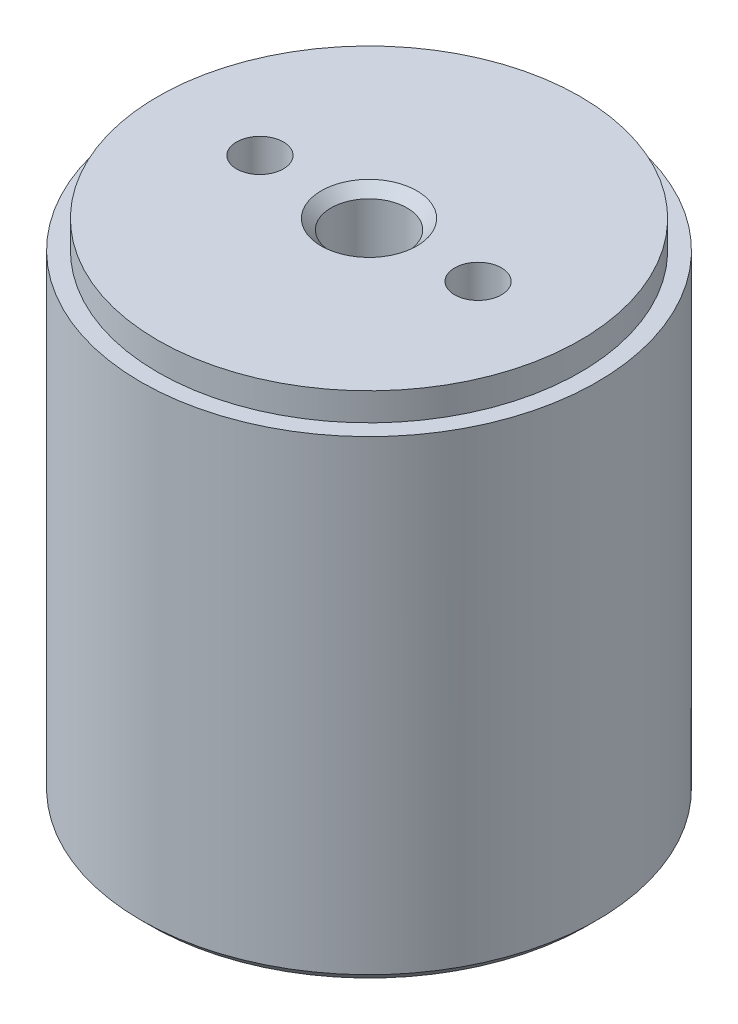
ISO-10303-21;
HEADER;
FILE_DESCRIPTION(('STEP AP214'),'2;1');
FILE_NAME('part.step','',(''),(''),'','','');
FILE_SCHEMA(('AUTOMOTIVE_DESIGN { 1 0 10303 214 1 1 1 1 }'));
ENDSEC;
DATA;
#1=APPLICATION_CONTEXT('core data for automotive mechanical design processes');
#2=APPLICATION_PROTOCOL_DEFINITION('international standard','automotive_design',2000,#1);
#3=PRODUCT_CONTEXT('',#1,'mechanical');
#4=PRODUCT('Part','Part','',(#3));
#5=PRODUCT_RELATED_PRODUCT_CATEGORY('part','',(#4));
#6=PRODUCT_DEFINITION_FORMATION('','',#4);
#7=PRODUCT_DEFINITION_CONTEXT('part definition',#1,'design');
#8=PRODUCT_DEFINITION('design','',#6,#7);
#9=PRODUCT_DEFINITION_SHAPE('','',#8);
#10=(LENGTH_UNIT() NAMED_UNIT(*) SI_UNIT(.MILLI.,.METRE.));
#11=(NAMED_UNIT(*) PLANE_ANGLE_UNIT() SI_UNIT($,.RADIAN.));
#12=(NAMED_UNIT(*) SI_UNIT($,.STERADIAN.) SOLID_ANGLE_UNIT());
#13=UNCERTAINTY_MEASURE_WITH_UNIT(LENGTH_MEASURE(1.E-05),#10,'distance_accuracy_value','');
#14=(GEOMETRIC_REPRESENTATION_CONTEXT(3) GLOBAL_UNCERTAINTY_ASSIGNED_CONTEXT((#13)) GLOBAL_UNIT_ASSIGNED_CONTEXT((#10,
#11,#12)) REPRESENTATION_CONTEXT('',''));
#15=CARTESIAN_POINT('',(0.,0.,0.));
#16=DIRECTION('',(0.,0.,1.));
#17=DIRECTION('',(1.,0.,0.));
#18=AXIS2_PLACEMENT_3D('',#15,#16,#17);
#19=CARTESIAN_POINT('',(0.,-4.,0.));
#20=DIRECTION('',(0.,1.,0.));
#21=DIRECTION('',(0.,0.,1.));
#22=AXIS2_PLACEMENT_3D('',#19,#20,#21);
#23=CYLINDRICAL_SURFACE('',#22,2.413);
#24=CARTESIAN_POINT('',(0.,-3.502,0.));
#25=DIRECTION('',(0.,-1.,0.));
#26=DIRECTION('',(0.,0.,-1.));
#27=AXIS2_PLACEMENT_3D('',#24,#25,#26);
#28=CIRCLE('',#27,2.413);
#29=CARTESIAN_POINT('',(0.,-3.502,-2.413));
#30=VERTEX_POINT('',#29);
#31=EDGE_CURVE('E45',#30,#30,#28,.F.);
#32=ORIENTED_EDGE('',*,*,#31,.T.);
#33=EDGE_LOOP('',(#32));
#34=FACE_BOUND('',#33,.T.);
#35=CARTESIAN_POINT('',(0.,-0.324609432571373,0.));
#36=DIRECTION('',(0.,1.,0.));
#37=DIRECTION('',(0.,0.,1.));
#38=AXIS2_PLACEMENT_3D('',#35,#36,#37);
#39=CIRCLE('',#38,2.413);
#40=CARTESIAN_POINT('',(0.,-0.324609432571373,2.413));
#41=VERTEX_POINT('',#40);
#42=EDGE_CURVE('E69',#41,#41,#39,.T.);
#43=ORIENTED_EDGE('',*,*,#42,.F.);
#44=EDGE_LOOP('',(#43));
#45=FACE_BOUND('',#44,.T.);
#46=ADVANCED_FACE('F30',(#34,#45),#23,.T.);
#47=CARTESIAN_POINT('',(2.413,-4.,0.));
#48=DIRECTION('',(0.,-1.,0.));
#49=DIRECTION('',(0.,0.,-1.));
#50=AXIS2_PLACEMENT_3D('',#47,#48,#49);
#51=PLANE('',#50);
#52=CARTESIAN_POINT('',(0.,-4.,0.));
#53=DIRECTION('',(0.,-1.,0.));
#54=DIRECTION('',(0.,0.,-1.));
#55=AXIS2_PLACEMENT_3D('',#52,#53,#54);
#56=CIRCLE('',#55,1.91499999999999);
#57=CARTESIAN_POINT('',(0.,-4.,-1.91499999999999));
#58=VERTEX_POINT('',#57);
#59=EDGE_CURVE('E41',#58,#58,#56,.T.);
#60=ORIENTED_EDGE('',*,*,#59,.T.);
#61=EDGE_LOOP('',(#60));
#62=FACE_BOUND('',#61,.T.);
#63=CARTESIAN_POINT('',(0.,-4.00000000000001,0.));
#64=DIRECTION('',(0.,-1.,0.));
#65=DIRECTION('',(0.,0.,-1.));
#66=AXIS2_PLACEMENT_3D('',#63,#64,#65);
#67=CIRCLE('',#66,1.18099999999999);
#68=CARTESIAN_POINT('',(0.,-4.00000000000001,-1.18099999999999));
#69=VERTEX_POINT('',#68);
#70=EDGE_CURVE('E92',#69,#69,#67,.T.);
#71=ORIENTED_EDGE('',*,*,#70,.F.);
#72=EDGE_LOOP('',(#71));
#73=FACE_BOUND('',#72,.T.);
#74=ADVANCED_FACE('F133',(#62,#73),#51,.T.);
#75=CARTESIAN_POINT('',(0.,24.,0.));
#76=DIRECTION('',(0.,1.,0.));
#77=DIRECTION('',(0.,0.,1.));
#78=AXIS2_PLACEMENT_3D('',#75,#76,#77);
#79=PLANE('',#78);
#80=CARTESIAN_POINT('',(0.,24.,0.));
#81=DIRECTION('',(0.,1.,0.));
#82=DIRECTION('',(0.,0.,1.));
#83=AXIS2_PLACEMENT_3D('',#80,#81,#82);
#84=CIRCLE('',#83,10.65);
#85=CARTESIAN_POINT('',(0.,24.,10.65));
#86=VERTEX_POINT('',#85);
#87=EDGE_CURVE('E56',#86,#86,#84,.T.);
#88=ORIENTED_EDGE('',*,*,#87,.F.);
#89=EDGE_LOOP('',(#88));
#90=FACE_BOUND('',#89,.T.);
#91=CARTESIAN_POINT('',(0.,24.,0.));
#92=DIRECTION('',(0.,1.,0.));
#93=DIRECTION('',(0.,0.,1.));
#94=AXIS2_PLACEMENT_3D('',#91,#92,#93);
#95=CIRCLE('',#94,11.5);
#96=CARTESIAN_POINT('',(0.,24.,11.5));
#97=VERTEX_POINT('',#96);
#98=EDGE_CURVE('E57',#97,#97,#95,.T.);
#99=ORIENTED_EDGE('',*,*,#98,.T.);
#100=EDGE_LOOP('',(#99));
#101=FACE_BOUND('',#100,.T.);
#102=ADVANCED_FACE('F129',(#90,#101),#79,.T.);
#103=CARTESIAN_POINT('',(0.,-4.,0.));
#104=DIRECTION('',(0.,1.,0.));
#105=DIRECTION('',(0.,0.,1.));
#106=AXIS2_PLACEMENT_3D('',#103,#104,#105);
#107=CYLINDRICAL_SURFACE('',#106,11.5);
#108=CARTESIAN_POINT('',(0.,0.498,0.));
#109=DIRECTION('',(0.,-1.,0.));
#110=DIRECTION('',(0.,0.,-1.));
#111=AXIS2_PLACEMENT_3D('',#108,#109,#110);
#112=CIRCLE('',#111,11.5);
#113=CARTESIAN_POINT('',(0.,0.498,-11.5));
#114=VERTEX_POINT('',#113);
#115=EDGE_CURVE('E53',#114,#114,#112,.F.);
#116=ORIENTED_EDGE('',*,*,#115,.T.);
#117=EDGE_LOOP('',(#116));
#118=FACE_BOUND('',#117,.T.);
#119=ORIENTED_EDGE('',*,*,#98,.F.);
#120=EDGE_LOOP('',(#119));
#121=FACE_BOUND('',#120,.T.);
#122=ADVANCED_FACE('F132',(#118,#121),#107,.T.);
#123=CARTESIAN_POINT('',(11.5,0.,0.));
#124=DIRECTION('',(0.,-1.,0.));
#125=DIRECTION('',(0.,0.,-1.));
#126=AXIS2_PLACEMENT_3D('',#123,#124,#125);
#127=PLANE('',#126);
#128=CARTESIAN_POINT('',(0.,0.,0.));
#129=DIRECTION('',(0.,-1.,0.));
#130=DIRECTION('',(0.,0.,-1.));
#131=AXIS2_PLACEMENT_3D('',#128,#129,#130);
#132=CIRCLE('',#131,11.002);
#133=CARTESIAN_POINT('',(0.,0.,-11.002));
#134=VERTEX_POINT('',#133);
#135=EDGE_CURVE('E50',#134,#134,#132,.T.);
#136=ORIENTED_EDGE('',*,*,#135,.T.);
#137=EDGE_LOOP('',(#136));
#138=FACE_BOUND('',#137,.T.);
#139=CARTESIAN_POINT('',(0.,0.,0.));
#140=DIRECTION('',(0.,1.,0.));
#141=DIRECTION('',(0.,0.,1.));
#142=AXIS2_PLACEMENT_3D('',#139,#140,#141);
#143=CIRCLE('',#142,8.83510678118655);
#144=CARTESIAN_POINT('',(0.,0.,8.83510678118655));
#145=VERTEX_POINT('',#144);
#146=EDGE_CURVE('E60',#145,#145,#143,.T.);
#147=ORIENTED_EDGE('',*,*,#146,.T.);
#148=EDGE_LOOP('',(#147));
#149=FACE_BOUND('',#148,.T.);
#150=ADVANCED_FACE('F138',(#138,#149),#127,.T.);
#151=CARTESIAN_POINT('',(0.,0.25,0.));
#152=DIRECTION('',(0.,1.,0.));
#153=DIRECTION('',(0.,0.,1.));
#154=AXIS2_PLACEMENT_3D('',#151,#152,#153);
#155=TOROIDAL_SURFACE('',#154,8.128,0.750000000000002);
#156=CARTESIAN_POINT('',(0.,0.,0.));
#157=DIRECTION('',(0.,1.,0.));
#158=DIRECTION('',(0.,0.,1.));
#159=AXIS2_PLACEMENT_3D('',#156,#157,#158);
#160=CIRCLE('',#159,7.42089321881345);
#161=CARTESIAN_POINT('',(0.,0.,7.42089321881345));
#162=VERTEX_POINT('',#161);
#163=EDGE_CURVE('E63',#162,#162,#160,.T.);
#164=ORIENTED_EDGE('',*,*,#163,.T.);
#165=EDGE_LOOP('',(#164));
#166=FACE_BOUND('',#165,.T.);
#167=ORIENTED_EDGE('',*,*,#146,.F.);
#168=EDGE_LOOP('',(#167));
#169=FACE_BOUND('',#168,.T.);
#170=ADVANCED_FACE('F144',(#166,#169),#155,.T.);
#171=CARTESIAN_POINT('',(7.42089321881345,0.,0.));
#172=DIRECTION('',(0.,-1.,0.));
#173=DIRECTION('',(0.,0.,-1.));
#174=AXIS2_PLACEMENT_3D('',#171,#172,#173);
#175=PLANE('',#174);
#176=CARTESIAN_POINT('',(5.50000000000004,0.,-1.38777878078145E-13));
#177=DIRECTION('',(0.,-1.,0.));
#178=DIRECTION('',(0.,0.,-1.));
#179=AXIS2_PLACEMENT_3D('',#176,#177,#178);
#180=CIRCLE('',#179,1.18099999999999);
#181=CARTESIAN_POINT('',(5.50000000000004,0.,-1.18100000000013));
#182=VERTEX_POINT('',#181);
#183=EDGE_CURVE('E86',#182,#182,#180,.T.);
#184=ORIENTED_EDGE('',*,*,#183,.F.);
#185=EDGE_LOOP('',(#184));
#186=FACE_BOUND('',#185,.T.);
#187=CARTESIAN_POINT('',(-5.50000000000003,0.,0.));
#188=DIRECTION('',(0.,-1.,0.));
#189=DIRECTION('',(0.,0.,-1.));
#190=AXIS2_PLACEMENT_3D('',#187,#188,#189);
#191=CIRCLE('',#190,1.18099999999999);
#192=CARTESIAN_POINT('',(-5.50000000000003,0.,-1.18100000000002));
#193=VERTEX_POINT('',#192);
#194=EDGE_CURVE('E80',#193,#193,#191,.T.);
#195=ORIENTED_EDGE('',*,*,#194,.F.);
#196=EDGE_LOOP('',(#195));
#197=FACE_BOUND('',#196,.T.);
#198=CARTESIAN_POINT('',(0.,0.,0.));
#199=DIRECTION('',(0.,1.,0.));
#200=DIRECTION('',(0.,0.,1.));
#201=AXIS2_PLACEMENT_3D('',#198,#199,#200);
#202=CIRCLE('',#201,3.60210678118655);
#203=CARTESIAN_POINT('',(0.,0.,3.60210678118655));
#204=VERTEX_POINT('',#203);
#205=EDGE_CURVE('E66',#204,#204,#202,.T.);
#206=ORIENTED_EDGE('',*,*,#205,.T.);
#207=EDGE_LOOP('',(#206));
#208=FACE_BOUND('',#207,.T.);
#209=ORIENTED_EDGE('',*,*,#163,.F.);
#210=EDGE_LOOP('',(#209));
#211=FACE_BOUND('',#210,.T.);
#212=ADVANCED_FACE('F208',(#186,#197,#208,#211),#175,.T.);
#213=CARTESIAN_POINT('',(0.,0.25,0.));
#214=DIRECTION('',(0.,1.,0.));
#215=DIRECTION('',(0.,0.,1.));
#216=AXIS2_PLACEMENT_3D('',#213,#214,#215);
#217=TOROIDAL_SURFACE('',#216,2.895,0.749999999999998);
#218=ORIENTED_EDGE('',*,*,#42,.T.);
#219=EDGE_LOOP('',(#218));
#220=FACE_BOUND('',#219,.T.);
#221=ORIENTED_EDGE('',*,*,#205,.F.);
#222=EDGE_LOOP('',(#221));
#223=FACE_BOUND('',#222,.T.);
#224=ADVANCED_FACE('F125',(#220,#223),#217,.T.);
#225=CARTESIAN_POINT('',(0.,25.4,0.));
#226=DIRECTION('',(0.,-1.,0.));
#227=DIRECTION('',(0.,0.,-1.));
#228=AXIS2_PLACEMENT_3D('',#225,#226,#227);
#229=CYLINDRICAL_SURFACE('',#228,10.65);
#230=CARTESIAN_POINT('',(0.,25.4,0.));
#231=DIRECTION('',(0.,1.,0.));
#232=DIRECTION('',(0.,0.,1.));
#233=AXIS2_PLACEMENT_3D('',#230,#231,#232);
#234=CIRCLE('',#233,10.65);
#235=CARTESIAN_POINT('',(0.,25.4,10.65));
#236=VERTEX_POINT('',#235);
#237=EDGE_CURVE('E72',#236,#236,#234,.T.);
#238=ORIENTED_EDGE('',*,*,#237,.F.);
#239=EDGE_LOOP('',(#238));
#240=FACE_BOUND('',#239,.T.);
#241=ORIENTED_EDGE('',*,*,#87,.T.);
#242=EDGE_LOOP('',(#241));
#243=FACE_BOUND('',#242,.T.);
#244=ADVANCED_FACE('F117',(#240,#243),#229,.T.);
#245=CARTESIAN_POINT('',(0.,25.4,0.));
#246=DIRECTION('',(0.,1.,0.));
#247=DIRECTION('',(0.,0.,1.));
#248=AXIS2_PLACEMENT_3D('',#245,#246,#247);
#249=PLANE('',#248);
#250=CARTESIAN_POINT('',(0.,25.4,0.));
#251=DIRECTION('',(0.,1.,0.));
#252=DIRECTION('',(0.,0.,1.));
#253=AXIS2_PLACEMENT_3D('',#250,#251,#252);
#254=CIRCLE('',#253,2.41299999999998);
#255=CARTESIAN_POINT('',(0.,25.4,2.41299999999998));
#256=VERTEX_POINT('',#255);
#257=EDGE_CURVE('E10',#256,#256,#254,.F.);
#258=ORIENTED_EDGE('',*,*,#257,.T.);
#259=EDGE_LOOP('',(#258));
#260=FACE_BOUND('',#259,.T.);
#261=CARTESIAN_POINT('',(5.50000000000004,25.4,-1.38777878078145E-13));
#262=DIRECTION('',(0.,1.,0.));
#263=DIRECTION('',(0.,0.,1.));
#264=AXIS2_PLACEMENT_3D('',#261,#262,#263);
#265=CIRCLE('',#264,1.18099999999999);
#266=CARTESIAN_POINT('',(5.50000000000004,25.4,1.18099999999985));
#267=VERTEX_POINT('',#266);
#268=EDGE_CURVE('E107',#267,#267,#265,.T.);
#269=ORIENTED_EDGE('',*,*,#268,.F.);
#270=EDGE_LOOP('',(#269));
#271=FACE_BOUND('',#270,.T.);
#272=CARTESIAN_POINT('',(-5.50000000000003,25.4,0.));
#273=DIRECTION('',(0.,1.,0.));
#274=DIRECTION('',(0.,0.,1.));
#275=AXIS2_PLACEMENT_3D('',#272,#273,#274);
#276=CIRCLE('',#275,1.18099999999999);
#277=CARTESIAN_POINT('',(-5.50000000000003,25.4,1.18099999999996));
#278=VERTEX_POINT('',#277);
#279=EDGE_CURVE('E101',#278,#278,#276,.T.);
#280=ORIENTED_EDGE('',*,*,#279,.F.);
#281=EDGE_LOOP('',(#280));
#282=FACE_BOUND('',#281,.T.);
#283=ORIENTED_EDGE('',*,*,#237,.T.);
#284=EDGE_LOOP('',(#283));
#285=FACE_BOUND('',#284,.T.);
#286=ADVANCED_FACE('F113',(#260,#271,#282,#285),#249,.T.);
#287=CARTESIAN_POINT('',(-5.50000000000003,5.,0.));
#288=DIRECTION('',(0.,1.,0.));
#289=DIRECTION('',(0.,0.,1.));
#290=AXIS2_PLACEMENT_3D('',#287,#288,#289);
#291=PLANE('',#290);
#292=CARTESIAN_POINT('',(-5.50000000000003,5.,0.));
#293=DIRECTION('',(0.,-1.,0.));
#294=DIRECTION('',(0.,0.,-1.));
#295=AXIS2_PLACEMENT_3D('',#292,#293,#294);
#296=CIRCLE('',#295,1.18099999999999);
#297=CARTESIAN_POINT('',(-5.50000000000003,5.,-1.18100000000002));
#298=VERTEX_POINT('',#297);
#299=EDGE_CURVE('E77',#298,#298,#296,.T.);
#300=ORIENTED_EDGE('',*,*,#299,.T.);
#301=EDGE_LOOP('',(#300));
#302=FACE_BOUND('',#301,.T.);
#303=ADVANCED_FACE('F116',(#302),#291,.F.);
#304=CARTESIAN_POINT('',(-5.50000000000003,0.,0.));
#305=DIRECTION('',(0.,-1.,0.));
#306=DIRECTION('',(0.,0.,-1.));
#307=AXIS2_PLACEMENT_3D('',#304,#305,#306);
#308=CYLINDRICAL_SURFACE('',#307,1.18099999999999);
#309=ORIENTED_EDGE('',*,*,#299,.F.);
#310=EDGE_LOOP('',(#309));
#311=FACE_BOUND('',#310,.T.);
#312=ORIENTED_EDGE('',*,*,#194,.T.);
#313=EDGE_LOOP('',(#312));
#314=FACE_BOUND('',#313,.T.);
#315=ADVANCED_FACE('F198',(#311,#314),#308,.F.);
#316=CARTESIAN_POINT('',(5.50000000000004,5.,-1.38777878078145E-13));
#317=DIRECTION('',(0.,1.,0.));
#318=DIRECTION('',(0.,0.,1.));
#319=AXIS2_PLACEMENT_3D('',#316,#317,#318);
#320=PLANE('',#319);
#321=CARTESIAN_POINT('',(5.50000000000004,5.,-1.38777878078145E-13));
#322=DIRECTION('',(0.,-1.,0.));
#323=DIRECTION('',(0.,0.,-1.));
#324=AXIS2_PLACEMENT_3D('',#321,#322,#323);
#325=CIRCLE('',#324,1.18099999999999);
#326=CARTESIAN_POINT('',(5.50000000000004,5.,-1.18100000000013));
#327=VERTEX_POINT('',#326);
#328=EDGE_CURVE('E83',#327,#327,#325,.T.);
#329=ORIENTED_EDGE('',*,*,#328,.T.);
#330=EDGE_LOOP('',(#329));
#331=FACE_BOUND('',#330,.T.);
#332=ADVANCED_FACE('F194',(#331),#320,.F.);
#333=CARTESIAN_POINT('',(5.50000000000004,0.,-1.38777878078145E-13));
#334=DIRECTION('',(0.,-1.,0.));
#335=DIRECTION('',(0.,0.,-1.));
#336=AXIS2_PLACEMENT_3D('',#333,#334,#335);
#337=CYLINDRICAL_SURFACE('',#336,1.18099999999999);
#338=ORIENTED_EDGE('',*,*,#328,.F.);
#339=EDGE_LOOP('',(#338));
#340=FACE_BOUND('',#339,.T.);
#341=ORIENTED_EDGE('',*,*,#183,.T.);
#342=EDGE_LOOP('',(#341));
#343=FACE_BOUND('',#342,.T.);
#344=ADVANCED_FACE('F186',(#340,#343),#337,.F.);
#345=CARTESIAN_POINT('',(0.,5.,0.));
#346=DIRECTION('',(0.,1.,0.));
#347=DIRECTION('',(0.,0.,1.));
#348=AXIS2_PLACEMENT_3D('',#345,#346,#347);
#349=PLANE('',#348);
#350=CARTESIAN_POINT('',(0.,5.,0.));
#351=DIRECTION('',(0.,-1.,0.));
#352=DIRECTION('',(0.,0.,-1.));
#353=AXIS2_PLACEMENT_3D('',#350,#351,#352);
#354=CIRCLE('',#353,1.18099999999999);
#355=CARTESIAN_POINT('',(0.,5.,-1.18099999999999));
#356=VERTEX_POINT('',#355);
#357=EDGE_CURVE('E89',#356,#356,#354,.T.);
#358=ORIENTED_EDGE('',*,*,#357,.T.);
#359=EDGE_LOOP('',(#358));
#360=FACE_BOUND('',#359,.T.);
#361=ADVANCED_FACE('F176',(#360),#349,.F.);
#362=CARTESIAN_POINT('',(0.,-4.,0.));
#363=DIRECTION('',(0.,-1.,0.));
#364=DIRECTION('',(0.,0.,-1.));
#365=AXIS2_PLACEMENT_3D('',#362,#363,#364);
#366=CYLINDRICAL_SURFACE('',#365,1.18099999999999);
#367=ORIENTED_EDGE('',*,*,#357,.F.);
#368=EDGE_LOOP('',(#367));
#369=FACE_BOUND('',#368,.T.);
#370=ORIENTED_EDGE('',*,*,#70,.T.);
#371=EDGE_LOOP('',(#370));
#372=FACE_BOUND('',#371,.T.);
#373=ADVANCED_FACE('F173',(#369,#372),#366,.F.);
#374=CARTESIAN_POINT('',(0.,20.4,0.));
#375=DIRECTION('',(0.,-1.,0.));
#376=DIRECTION('',(0.,0.,-1.));
#377=AXIS2_PLACEMENT_3D('',#374,#375,#376);
#378=PLANE('',#377);
#379=CARTESIAN_POINT('',(0.,20.4,0.));
#380=DIRECTION('',(0.,1.,0.));
#381=DIRECTION('',(0.,0.,1.));
#382=AXIS2_PLACEMENT_3D('',#379,#380,#381);
#383=CIRCLE('',#382,1.91499999999999);
#384=CARTESIAN_POINT('',(0.,20.4,1.91499999999999));
#385=VERTEX_POINT('',#384);
#386=EDGE_CURVE('E95',#385,#385,#383,.T.);
#387=ORIENTED_EDGE('',*,*,#386,.T.);
#388=EDGE_LOOP('',(#387));
#389=FACE_BOUND('',#388,.T.);
#390=ADVANCED_FACE('F175',(#389),#378,.F.);
#391=CARTESIAN_POINT('',(0.,25.4,0.));
#392=DIRECTION('',(0.,1.,0.));
#393=DIRECTION('',(0.,0.,1.));
#394=AXIS2_PLACEMENT_3D('',#391,#392,#393);
#395=CYLINDRICAL_SURFACE('',#394,1.91499999999999);
#396=CARTESIAN_POINT('',(0.,24.902,0.));
#397=DIRECTION('',(0.,1.,0.));
#398=DIRECTION('',(0.,0.,1.));
#399=AXIS2_PLACEMENT_3D('',#396,#397,#398);
#400=CIRCLE('',#399,1.91499999999999);
#401=CARTESIAN_POINT('',(0.,24.902,1.91499999999999));
#402=VERTEX_POINT('',#401);
#403=EDGE_CURVE('E37',#402,#402,#400,.T.);
#404=ORIENTED_EDGE('',*,*,#403,.T.);
#405=EDGE_LOOP('',(#404));
#406=FACE_BOUND('',#405,.T.);
#407=ORIENTED_EDGE('',*,*,#386,.F.);
#408=EDGE_LOOP('',(#407));
#409=FACE_BOUND('',#408,.T.);
#410=ADVANCED_FACE('F183',(#406,#409),#395,.F.);
#411=CARTESIAN_POINT('',(-5.50000000000003,20.4,0.));
#412=DIRECTION('',(0.,-1.,0.));
#413=DIRECTION('',(0.,0.,-1.));
#414=AXIS2_PLACEMENT_3D('',#411,#412,#413);
#415=PLANE('',#414);
#416=CARTESIAN_POINT('',(-5.50000000000003,20.4,0.));
#417=DIRECTION('',(0.,1.,0.));
#418=DIRECTION('',(0.,0.,1.));
#419=AXIS2_PLACEMENT_3D('',#416,#417,#418);
#420=CIRCLE('',#419,1.18099999999999);
#421=CARTESIAN_POINT('',(-5.50000000000003,20.4,1.18099999999996));
#422=VERTEX_POINT('',#421);
#423=EDGE_CURVE('E98',#422,#422,#420,.T.);
#424=ORIENTED_EDGE('',*,*,#423,.T.);
#425=EDGE_LOOP('',(#424));
#426=FACE_BOUND('',#425,.T.);
#427=ADVANCED_FACE('F279',(#426),#415,.F.);
#428=CARTESIAN_POINT('',(-5.50000000000003,25.4,0.));
#429=DIRECTION('',(0.,1.,0.));
#430=DIRECTION('',(0.,0.,1.));
#431=AXIS2_PLACEMENT_3D('',#428,#429,#430);
#432=CYLINDRICAL_SURFACE('',#431,1.18099999999999);
#433=ORIENTED_EDGE('',*,*,#423,.F.);
#434=EDGE_LOOP('',(#433));
#435=FACE_BOUND('',#434,.T.);
#436=ORIENTED_EDGE('',*,*,#279,.T.);
#437=EDGE_LOOP('',(#436));
#438=FACE_BOUND('',#437,.T.);
#439=ADVANCED_FACE('F284',(#435,#438),#432,.F.);
#440=CARTESIAN_POINT('',(5.50000000000004,20.4,-1.38777878078145E-13));
#441=DIRECTION('',(0.,-1.,0.));
#442=DIRECTION('',(0.,0.,-1.));
#443=AXIS2_PLACEMENT_3D('',#440,#441,#442);
#444=PLANE('',#443);
#445=CARTESIAN_POINT('',(5.50000000000004,20.4,-1.38777878078145E-13));
#446=DIRECTION('',(0.,1.,0.));
#447=DIRECTION('',(0.,0.,1.));
#448=AXIS2_PLACEMENT_3D('',#445,#446,#447);
#449=CIRCLE('',#448,1.18099999999999);
#450=CARTESIAN_POINT('',(5.50000000000004,20.4,1.18099999999985));
#451=VERTEX_POINT('',#450);
#452=EDGE_CURVE('E104',#451,#451,#449,.T.);
#453=ORIENTED_EDGE('',*,*,#452,.T.);
#454=EDGE_LOOP('',(#453));
#455=FACE_BOUND('',#454,.T.);
#456=ADVANCED_FACE('F294',(#455),#444,.F.);
#457=CARTESIAN_POINT('',(5.50000000000004,25.4,-1.38777878078145E-13));
#458=DIRECTION('',(0.,1.,0.));
#459=DIRECTION('',(0.,0.,1.));
#460=AXIS2_PLACEMENT_3D('',#457,#458,#459);
#461=CYLINDRICAL_SURFACE('',#460,1.18099999999999);
#462=ORIENTED_EDGE('',*,*,#452,.F.);
#463=EDGE_LOOP('',(#462));
#464=FACE_BOUND('',#463,.T.);
#465=ORIENTED_EDGE('',*,*,#268,.T.);
#466=EDGE_LOOP('',(#465));
#467=FACE_BOUND('',#466,.T.);
#468=ADVANCED_FACE('F111',(#464,#467),#461,.F.);
#469=CARTESIAN_POINT('',(0.,0.498,0.));
#470=DIRECTION('',(0.,1.,0.));
#471=DIRECTION('',(0.,0.,1.));
#472=AXIS2_PLACEMENT_3D('',#469,#470,#471);
#473=CONICAL_SURFACE('',#472,11.5,0.785398163397454);
#474=ORIENTED_EDGE('',*,*,#135,.F.);
#475=EDGE_LOOP('',(#474));
#476=FACE_BOUND('',#475,.T.);
#477=ORIENTED_EDGE('',*,*,#115,.F.);
#478=EDGE_LOOP('',(#477));
#479=FACE_BOUND('',#478,.T.);
#480=ADVANCED_FACE('F157',(#476,#479),#473,.T.);
#481=CARTESIAN_POINT('',(0.,-3.502,0.));
#482=DIRECTION('',(0.,1.,0.));
#483=DIRECTION('',(0.,0.,1.));
#484=AXIS2_PLACEMENT_3D('',#481,#482,#483);
#485=CONICAL_SURFACE('',#484,2.413,0.785398163397454);
#486=ORIENTED_EDGE('',*,*,#59,.F.);
#487=EDGE_LOOP('',(#486));
#488=FACE_BOUND('',#487,.T.);
#489=ORIENTED_EDGE('',*,*,#31,.F.);
#490=EDGE_LOOP('',(#489));
#491=FACE_BOUND('',#490,.T.);
#492=ADVANCED_FACE('F159',(#488,#491),#485,.T.);
#493=CARTESIAN_POINT('',(0.,24.902,0.));
#494=DIRECTION('',(0.,1.,0.));
#495=DIRECTION('',(0.,0.,1.));
#496=AXIS2_PLACEMENT_3D('',#493,#494,#495);
#497=CONICAL_SURFACE('',#496,1.91499999999999,0.785398163397453);
#498=ORIENTED_EDGE('',*,*,#257,.F.);
#499=EDGE_LOOP('',(#498));
#500=FACE_BOUND('',#499,.T.);
#501=ORIENTED_EDGE('',*,*,#403,.F.);
#502=EDGE_LOOP('',(#501));
#503=FACE_BOUND('',#502,.T.);
#504=ADVANCED_FACE('F32',(#500,#503),#497,.F.);
#505=CLOSED_SHELL('',(#46,#74,#102,#122,#150,#170,#212,#224,#244,#286,#303,#315,#332,#344,#361,
#373,#390,#410,#427,#439,#456,#468,#480,#492,#504));
#506=MANIFOLD_SOLID_BREP('B2',#505);
#507=ADVANCED_BREP_SHAPE_REPRESENTATION('',(#18,#506),#14);
#508=SHAPE_DEFINITION_REPRESENTATION(#9,#507);
ENDSEC;
END-ISO-10303-21;
